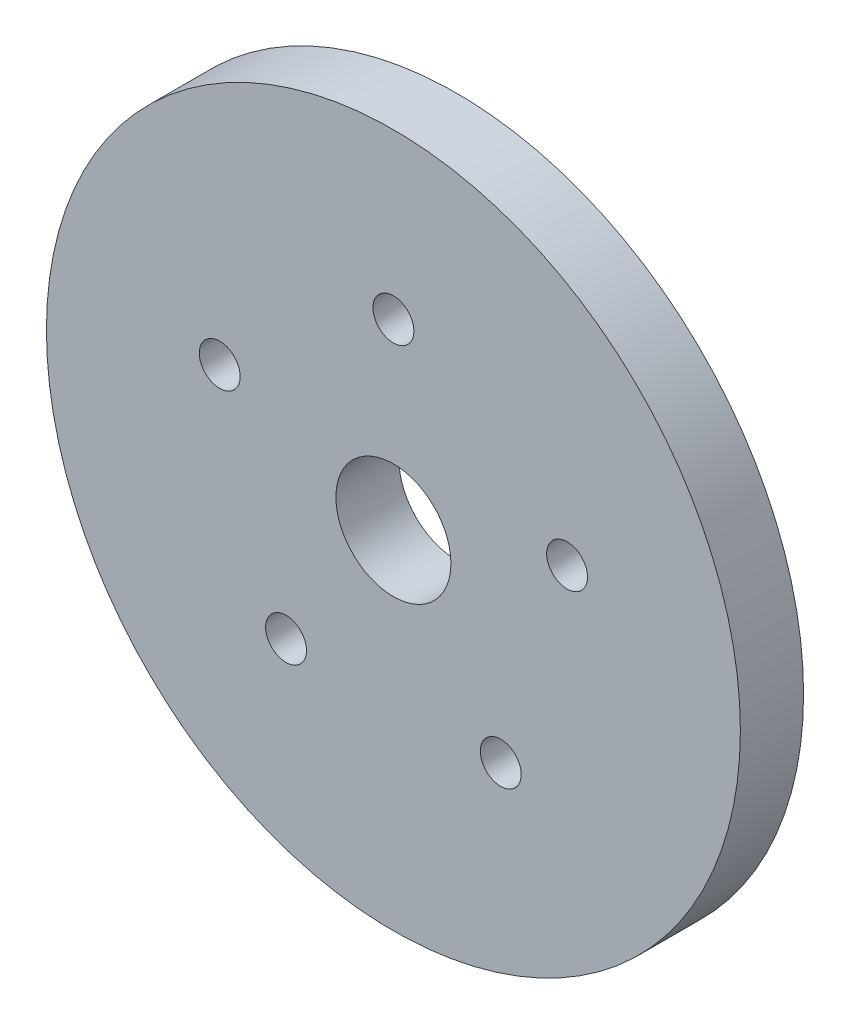
ISO-10303-21;
HEADER;
FILE_DESCRIPTION(('STEP AP214'),'2;1');
FILE_NAME('part.step','',(''),(''),'','','');
FILE_SCHEMA(('AUTOMOTIVE_DESIGN { 1 0 10303 214 1 1 1 1 }'));
ENDSEC;
DATA;
#1=APPLICATION_CONTEXT('core data for automotive mechanical design processes');
#2=APPLICATION_PROTOCOL_DEFINITION('international standard','automotive_design',2000,#1);
#3=PRODUCT_CONTEXT('',#1,'mechanical');
#4=PRODUCT('Part','Part','',(#3));
#5=PRODUCT_RELATED_PRODUCT_CATEGORY('part','',(#4));
#6=PRODUCT_DEFINITION_FORMATION('','',#4);
#7=PRODUCT_DEFINITION_CONTEXT('part definition',#1,'design');
#8=PRODUCT_DEFINITION('design','',#6,#7);
#9=PRODUCT_DEFINITION_SHAPE('','',#8);
#10=(LENGTH_UNIT() NAMED_UNIT(*) SI_UNIT(.MILLI.,.METRE.));
#11=(NAMED_UNIT(*) PLANE_ANGLE_UNIT() SI_UNIT($,.RADIAN.));
#12=(NAMED_UNIT(*) SI_UNIT($,.STERADIAN.) SOLID_ANGLE_UNIT());
#13=UNCERTAINTY_MEASURE_WITH_UNIT(LENGTH_MEASURE(1.E-05),#10,'distance_accuracy_value','');
#14=(GEOMETRIC_REPRESENTATION_CONTEXT(3) GLOBAL_UNCERTAINTY_ASSIGNED_CONTEXT((#13)) GLOBAL_UNIT_ASSIGNED_CONTEXT((#10,
#11,#12)) REPRESENTATION_CONTEXT('',''));
#15=CARTESIAN_POINT('',(0.,0.,0.));
#16=DIRECTION('',(0.,0.,1.));
#17=DIRECTION('',(1.,0.,0.));
#18=AXIS2_PLACEMENT_3D('',#15,#16,#17);
#19=CARTESIAN_POINT('',(0.,0.,4.3942));
#20=DIRECTION('',(0.,0.,1.));
#21=DIRECTION('',(1.,0.,0.));
#22=AXIS2_PLACEMENT_3D('',#19,#20,#21);
#23=PLANE('',#22);
#24=CARTESIAN_POINT('',(-7.46487270411363,-10.2745158285621,4.3942));
#25=DIRECTION('',(0.,0.,1.));
#26=DIRECTION('',(1.,0.,0.));
#27=AXIS2_PLACEMENT_3D('',#24,#25,#26);
#28=CIRCLE('',#27,1.4224);
#29=CARTESIAN_POINT('',(-6.04247270411363,-10.2745158285621,4.3942));
#30=VERTEX_POINT('',#29);
#31=EDGE_CURVE('E65',#30,#30,#28,.T.);
#32=ORIENTED_EDGE('',*,*,#31,.F.);
#33=EDGE_LOOP('',(#32));
#34=FACE_BOUND('',#33,.T.);
#35=CARTESIAN_POINT('',(12.0784177569487,3.92451582856225,4.3942));
#36=DIRECTION('',(0.,0.,1.));
#37=DIRECTION('',(1.,0.,0.));
#38=AXIS2_PLACEMENT_3D('',#35,#36,#37);
#39=CIRCLE('',#38,1.4224);
#40=CARTESIAN_POINT('',(13.5008177569488,3.92451582856225,4.3942));
#41=VERTEX_POINT('',#40);
#42=EDGE_CURVE('E53',#41,#41,#39,.T.);
#43=ORIENTED_EDGE('',*,*,#42,.F.);
#44=EDGE_LOOP('',(#43));
#45=FACE_BOUND('',#44,.T.);
#46=CARTESIAN_POINT('',(0.,12.7,4.3942));
#47=DIRECTION('',(0.,0.,1.));
#48=DIRECTION('',(1.,0.,0.));
#49=AXIS2_PLACEMENT_3D('',#46,#47,#48);
#50=CIRCLE('',#49,1.4224);
#51=CARTESIAN_POINT('',(1.4224,12.7,4.3942));
#52=VERTEX_POINT('',#51);
#53=EDGE_CURVE('E42',#52,#52,#50,.T.);
#54=ORIENTED_EDGE('',*,*,#53,.F.);
#55=EDGE_LOOP('',(#54));
#56=FACE_BOUND('',#55,.T.);
#57=CARTESIAN_POINT('',(0.,0.,4.3942));
#58=DIRECTION('',(0.,0.,1.));
#59=DIRECTION('',(1.,0.,0.));
#60=AXIS2_PLACEMENT_3D('',#57,#58,#59);
#61=CIRCLE('',#60,24.13);
#62=CARTESIAN_POINT('',(24.13,0.,4.3942));
#63=VERTEX_POINT('',#62);
#64=EDGE_CURVE('E10',#63,#63,#61,.T.);
#65=ORIENTED_EDGE('',*,*,#64,.T.);
#66=EDGE_LOOP('',(#65));
#67=FACE_BOUND('',#66,.T.);
#68=CARTESIAN_POINT('',(0.,0.,4.3942));
#69=DIRECTION('',(0.,0.,1.));
#70=DIRECTION('',(1.,0.,0.));
#71=AXIS2_PLACEMENT_3D('',#68,#69,#70);
#72=CIRCLE('',#71,4.);
#73=CARTESIAN_POINT('',(4.,0.,4.3942));
#74=VERTEX_POINT('',#73);
#75=EDGE_CURVE('E47',#74,#74,#72,.T.);
#76=ORIENTED_EDGE('',*,*,#75,.F.);
#77=EDGE_LOOP('',(#76));
#78=FACE_BOUND('',#77,.T.);
#79=CARTESIAN_POINT('',(7.46487270411519,-10.2745158285616,4.3942));
#80=DIRECTION('',(0.,0.,1.));
#81=DIRECTION('',(1.,0.,0.));
#82=AXIS2_PLACEMENT_3D('',#79,#80,#81);
#83=CIRCLE('',#82,1.4224);
#84=CARTESIAN_POINT('',(8.88727270411519,-10.2745158285616,4.3942));
#85=VERTEX_POINT('',#84);
#86=EDGE_CURVE('E59',#85,#85,#83,.T.);
#87=ORIENTED_EDGE('',*,*,#86,.F.);
#88=EDGE_LOOP('',(#87));
#89=FACE_BOUND('',#88,.T.);
#90=CARTESIAN_POINT('',(-12.0784177569482,3.92451582856142,4.3942));
#91=DIRECTION('',(0.,0.,1.));
#92=DIRECTION('',(1.,0.,0.));
#93=AXIS2_PLACEMENT_3D('',#90,#91,#92);
#94=CIRCLE('',#93,1.4224);
#95=CARTESIAN_POINT('',(-10.6560177569482,3.92451582856142,4.3942));
#96=VERTEX_POINT('',#95);
#97=EDGE_CURVE('E71',#96,#96,#94,.T.);
#98=ORIENTED_EDGE('',*,*,#97,.F.);
#99=EDGE_LOOP('',(#98));
#100=FACE_BOUND('',#99,.T.);
#101=ADVANCED_FACE('F31',(#34,#45,#56,#67,#78,#89,#100),#23,.T.);
#102=CARTESIAN_POINT('',(0.,0.,0.));
#103=DIRECTION('',(0.,0.,1.));
#104=DIRECTION('',(1.,0.,0.));
#105=AXIS2_PLACEMENT_3D('',#102,#103,#104);
#106=PLANE('',#105);
#107=CARTESIAN_POINT('',(-7.46487270411363,-10.2745158285621,0.));
#108=DIRECTION('',(0.,0.,1.));
#109=DIRECTION('',(1.,0.,0.));
#110=AXIS2_PLACEMENT_3D('',#107,#108,#109);
#111=CIRCLE('',#110,1.4224);
#112=CARTESIAN_POINT('',(-6.04247270411363,-10.2745158285621,0.));
#113=VERTEX_POINT('',#112);
#114=EDGE_CURVE('E68',#113,#113,#111,.T.);
#115=ORIENTED_EDGE('',*,*,#114,.T.);
#116=EDGE_LOOP('',(#115));
#117=FACE_BOUND('',#116,.T.);
#118=CARTESIAN_POINT('',(12.0784177569487,3.92451582856225,0.));
#119=DIRECTION('',(0.,0.,1.));
#120=DIRECTION('',(1.,0.,0.));
#121=AXIS2_PLACEMENT_3D('',#118,#119,#120);
#122=CIRCLE('',#121,1.4224);
#123=CARTESIAN_POINT('',(13.5008177569488,3.92451582856225,0.));
#124=VERTEX_POINT('',#123);
#125=EDGE_CURVE('E56',#124,#124,#122,.T.);
#126=ORIENTED_EDGE('',*,*,#125,.T.);
#127=EDGE_LOOP('',(#126));
#128=FACE_BOUND('',#127,.T.);
#129=CARTESIAN_POINT('',(0.,12.7,0.));
#130=DIRECTION('',(0.,0.,1.));
#131=DIRECTION('',(1.,0.,0.));
#132=AXIS2_PLACEMENT_3D('',#129,#130,#131);
#133=CIRCLE('',#132,1.4224);
#134=CARTESIAN_POINT('',(1.4224,12.7,0.));
#135=VERTEX_POINT('',#134);
#136=EDGE_CURVE('E44',#135,#135,#133,.T.);
#137=ORIENTED_EDGE('',*,*,#136,.T.);
#138=EDGE_LOOP('',(#137));
#139=FACE_BOUND('',#138,.T.);
#140=CARTESIAN_POINT('',(0.,0.,0.));
#141=DIRECTION('',(0.,0.,1.));
#142=DIRECTION('',(1.,0.,0.));
#143=AXIS2_PLACEMENT_3D('',#140,#141,#142);
#144=CIRCLE('',#143,24.13);
#145=CARTESIAN_POINT('',(24.13,0.,0.));
#146=VERTEX_POINT('',#145);
#147=EDGE_CURVE('E35',#146,#146,#144,.T.);
#148=ORIENTED_EDGE('',*,*,#147,.F.);
#149=EDGE_LOOP('',(#148));
#150=FACE_BOUND('',#149,.T.);
#151=CARTESIAN_POINT('',(0.,0.,0.));
#152=DIRECTION('',(0.,0.,1.));
#153=DIRECTION('',(1.,0.,0.));
#154=AXIS2_PLACEMENT_3D('',#151,#152,#153);
#155=CIRCLE('',#154,4.);
#156=CARTESIAN_POINT('',(4.,0.,0.));
#157=VERTEX_POINT('',#156);
#158=EDGE_CURVE('E50',#157,#157,#155,.T.);
#159=ORIENTED_EDGE('',*,*,#158,.T.);
#160=EDGE_LOOP('',(#159));
#161=FACE_BOUND('',#160,.T.);
#162=CARTESIAN_POINT('',(7.46487270411519,-10.2745158285616,0.));
#163=DIRECTION('',(0.,0.,1.));
#164=DIRECTION('',(1.,0.,0.));
#165=AXIS2_PLACEMENT_3D('',#162,#163,#164);
#166=CIRCLE('',#165,1.4224);
#167=CARTESIAN_POINT('',(8.88727270411519,-10.2745158285616,0.));
#168=VERTEX_POINT('',#167);
#169=EDGE_CURVE('E62',#168,#168,#166,.T.);
#170=ORIENTED_EDGE('',*,*,#169,.T.);
#171=EDGE_LOOP('',(#170));
#172=FACE_BOUND('',#171,.T.);
#173=CARTESIAN_POINT('',(-12.0784177569482,3.92451582856142,0.));
#174=DIRECTION('',(0.,0.,1.));
#175=DIRECTION('',(1.,0.,0.));
#176=AXIS2_PLACEMENT_3D('',#173,#174,#175);
#177=CIRCLE('',#176,1.4224);
#178=CARTESIAN_POINT('',(-10.6560177569482,3.92451582856142,0.));
#179=VERTEX_POINT('',#178);
#180=EDGE_CURVE('E74',#179,#179,#177,.T.);
#181=ORIENTED_EDGE('',*,*,#180,.T.);
#182=EDGE_LOOP('',(#181));
#183=FACE_BOUND('',#182,.T.);
#184=ADVANCED_FACE('F84',(#117,#128,#139,#150,#161,#172,#183),#106,.F.);
#185=CARTESIAN_POINT('',(0.,0.,4.3942));
#186=DIRECTION('',(0.,0.,-1.));
#187=DIRECTION('',(-1.,0.,0.));
#188=AXIS2_PLACEMENT_3D('',#185,#186,#187);
#189=CYLINDRICAL_SURFACE('',#188,24.13);
#190=ORIENTED_EDGE('',*,*,#64,.F.);
#191=EDGE_LOOP('',(#190));
#192=FACE_BOUND('',#191,.T.);
#193=ORIENTED_EDGE('',*,*,#147,.T.);
#194=EDGE_LOOP('',(#193));
#195=FACE_BOUND('',#194,.T.);
#196=ADVANCED_FACE('F33',(#192,#195),#189,.T.);
#197=CARTESIAN_POINT('',(0.,12.7,4.3942));
#198=DIRECTION('',(0.,0.,-1.));
#199=DIRECTION('',(-1.,0.,0.));
#200=AXIS2_PLACEMENT_3D('',#197,#198,#199);
#201=CYLINDRICAL_SURFACE('',#200,1.4224);
#202=ORIENTED_EDGE('',*,*,#53,.T.);
#203=EDGE_LOOP('',(#202));
#204=FACE_BOUND('',#203,.T.);
#205=ORIENTED_EDGE('',*,*,#136,.F.);
#206=EDGE_LOOP('',(#205));
#207=FACE_BOUND('',#206,.T.);
#208=ADVANCED_FACE('F94',(#204,#207),#201,.F.);
#209=CARTESIAN_POINT('',(0.,0.,4.3942));
#210=DIRECTION('',(0.,0.,-1.));
#211=DIRECTION('',(-1.,0.,0.));
#212=AXIS2_PLACEMENT_3D('',#209,#210,#211);
#213=CYLINDRICAL_SURFACE('',#212,4.);
#214=ORIENTED_EDGE('',*,*,#75,.T.);
#215=EDGE_LOOP('',(#214));
#216=FACE_BOUND('',#215,.T.);
#217=ORIENTED_EDGE('',*,*,#158,.F.);
#218=EDGE_LOOP('',(#217));
#219=FACE_BOUND('',#218,.T.);
#220=ADVANCED_FACE('F97',(#216,#219),#213,.F.);
#221=CARTESIAN_POINT('',(12.0784177569487,3.92451582856225,4.3942));
#222=DIRECTION('',(0.,0.,-1.));
#223=DIRECTION('',(-1.,0.,0.));
#224=AXIS2_PLACEMENT_3D('',#221,#222,#223);
#225=CYLINDRICAL_SURFACE('',#224,1.4224);
#226=ORIENTED_EDGE('',*,*,#42,.T.);
#227=EDGE_LOOP('',(#226));
#228=FACE_BOUND('',#227,.T.);
#229=ORIENTED_EDGE('',*,*,#125,.F.);
#230=EDGE_LOOP('',(#229));
#231=FACE_BOUND('',#230,.T.);
#232=ADVANCED_FACE('F101',(#228,#231),#225,.F.);
#233=CARTESIAN_POINT('',(7.46487270411519,-10.2745158285616,4.3942));
#234=DIRECTION('',(0.,0.,-1.));
#235=DIRECTION('',(-1.,0.,0.));
#236=AXIS2_PLACEMENT_3D('',#233,#234,#235);
#237=CYLINDRICAL_SURFACE('',#236,1.4224);
#238=ORIENTED_EDGE('',*,*,#86,.T.);
#239=EDGE_LOOP('',(#238));
#240=FACE_BOUND('',#239,.T.);
#241=ORIENTED_EDGE('',*,*,#169,.F.);
#242=EDGE_LOOP('',(#241));
#243=FACE_BOUND('',#242,.T.);
#244=ADVANCED_FACE('F105',(#240,#243),#237,.F.);
#245=CARTESIAN_POINT('',(-7.46487270411363,-10.2745158285621,4.3942));
#246=DIRECTION('',(0.,0.,-1.));
#247=DIRECTION('',(-1.,0.,0.));
#248=AXIS2_PLACEMENT_3D('',#245,#246,#247);
#249=CYLINDRICAL_SURFACE('',#248,1.4224);
#250=ORIENTED_EDGE('',*,*,#31,.T.);
#251=EDGE_LOOP('',(#250));
#252=FACE_BOUND('',#251,.T.);
#253=ORIENTED_EDGE('',*,*,#114,.F.);
#254=EDGE_LOOP('',(#253));
#255=FACE_BOUND('',#254,.T.);
#256=ADVANCED_FACE('F109',(#252,#255),#249,.F.);
#257=CARTESIAN_POINT('',(-12.0784177569482,3.92451582856142,4.3942));
#258=DIRECTION('',(0.,0.,-1.));
#259=DIRECTION('',(-1.,0.,0.));
#260=AXIS2_PLACEMENT_3D('',#257,#258,#259);
#261=CYLINDRICAL_SURFACE('',#260,1.4224);
#262=ORIENTED_EDGE('',*,*,#97,.T.);
#263=EDGE_LOOP('',(#262));
#264=FACE_BOUND('',#263,.T.);
#265=ORIENTED_EDGE('',*,*,#180,.F.);
#266=EDGE_LOOP('',(#265));
#267=FACE_BOUND('',#266,.T.);
#268=ADVANCED_FACE('F80',(#264,#267),#261,.F.);
#269=CLOSED_SHELL('',(#101,#184,#196,#208,#220,#232,#244,#256,#268));
#270=MANIFOLD_SOLID_BREP('B2',#269);
#271=ADVANCED_BREP_SHAPE_REPRESENTATION('',(#18,#270),#14);
#272=SHAPE_DEFINITION_REPRESENTATION(#9,#271);
ENDSEC;
END-ISO-10303-21;
